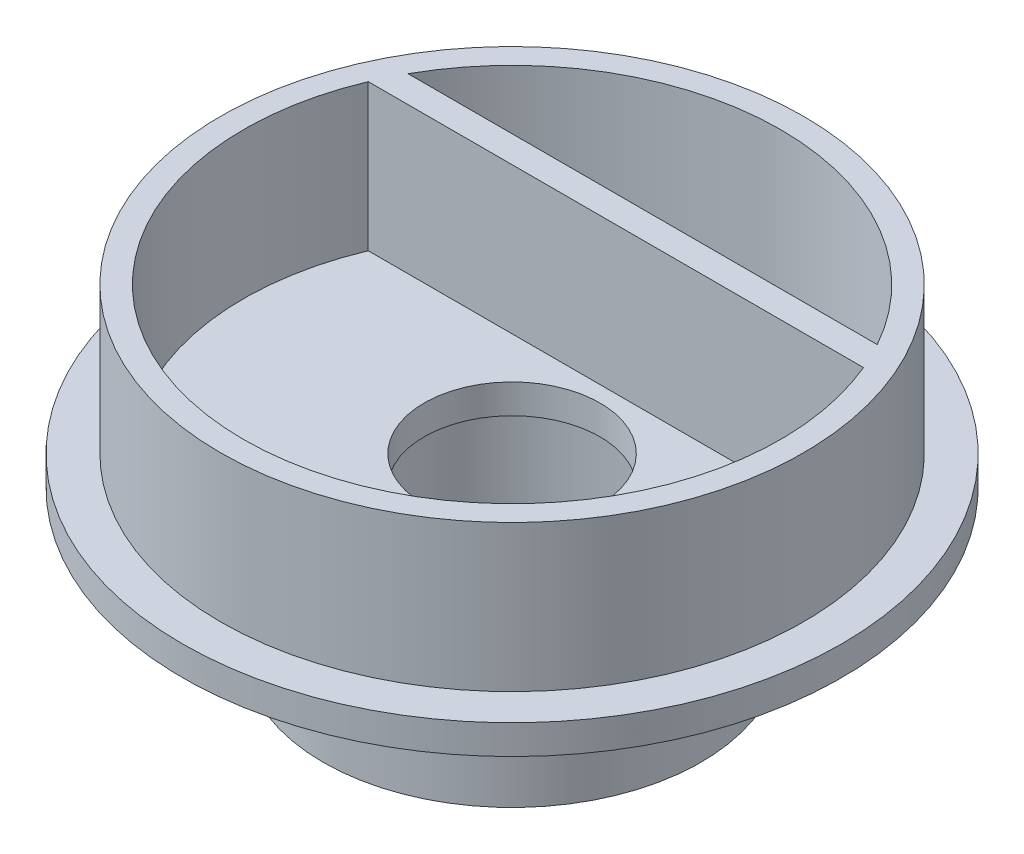
ISO-10303-21;
HEADER;
FILE_DESCRIPTION(('STEP AP214'),'2;1');
FILE_NAME('part.step','',(''),(''),'','','');
FILE_SCHEMA(('AUTOMOTIVE_DESIGN { 1 0 10303 214 1 1 1 1 }'));
ENDSEC;
DATA;
#1=APPLICATION_CONTEXT('core data for automotive mechanical design processes');
#2=APPLICATION_PROTOCOL_DEFINITION('international standard','automotive_design',2000,#1);
#3=PRODUCT_CONTEXT('',#1,'mechanical');
#4=PRODUCT('Part','Part','',(#3));
#5=PRODUCT_RELATED_PRODUCT_CATEGORY('part','',(#4));
#6=PRODUCT_DEFINITION_FORMATION('','',#4);
#7=PRODUCT_DEFINITION_CONTEXT('part definition',#1,'design');
#8=PRODUCT_DEFINITION('design','',#6,#7);
#9=PRODUCT_DEFINITION_SHAPE('','',#8);
#10=(LENGTH_UNIT() NAMED_UNIT(*) SI_UNIT(.MILLI.,.METRE.));
#11=(NAMED_UNIT(*) PLANE_ANGLE_UNIT() SI_UNIT($,.RADIAN.));
#12=(NAMED_UNIT(*) SI_UNIT($,.STERADIAN.) SOLID_ANGLE_UNIT());
#13=UNCERTAINTY_MEASURE_WITH_UNIT(LENGTH_MEASURE(1.E-05),#10,'distance_accuracy_value','');
#14=(GEOMETRIC_REPRESENTATION_CONTEXT(3) GLOBAL_UNCERTAINTY_ASSIGNED_CONTEXT((#13)) GLOBAL_UNIT_ASSIGNED_CONTEXT((#10,
#11,#12)) REPRESENTATION_CONTEXT('',''));
#15=CARTESIAN_POINT('',(0.,0.,0.));
#16=DIRECTION('',(0.,0.,1.));
#17=DIRECTION('',(1.,0.,0.));
#18=AXIS2_PLACEMENT_3D('',#15,#16,#17);
#19=CARTESIAN_POINT('',(0.,12.,0.));
#20=DIRECTION('',(0.,1.,0.));
#21=DIRECTION('',(0.,0.,1.));
#22=AXIS2_PLACEMENT_3D('',#19,#20,#21);
#23=PLANE('',#22);
#24=CARTESIAN_POINT('',(0.,12.,0.));
#25=DIRECTION('',(0.,1.,0.));
#26=DIRECTION('',(0.,0.,1.));
#27=AXIS2_PLACEMENT_3D('',#24,#25,#26);
#28=CIRCLE('',#27,18.3297555993307);
#29=CARTESIAN_POINT('',(16.9048097709622,12.,-7.08571428571429));
#30=VERTEX_POINT('',#29);
#31=CARTESIAN_POINT('',(-16.9048097709622,12.,-7.08571428571428));
#32=VERTEX_POINT('',#31);
#33=EDGE_CURVE('E234',#30,#32,#28,.F.);
#34=ORIENTED_EDGE('',*,*,#33,.T.);
#35=DIRECTION('',(1.,0.,0.));
#36=VECTOR('',#35,1.);
#37=CARTESIAN_POINT('',(0.,12.,-7.08571428571428));
#38=LINE('',#37,#36);
#39=EDGE_CURVE('E250',#32,#30,#38,.T.);
#40=ORIENTED_EDGE('',*,*,#39,.T.);
#41=EDGE_LOOP('',(#34,#40));
#42=FACE_BOUND('',#41,.T.);
#43=CARTESIAN_POINT('',(0.,12.,0.));
#44=DIRECTION('',(0.,1.,0.));
#45=DIRECTION('',(0.,0.,1.));
#46=AXIS2_PLACEMENT_3D('',#43,#44,#45);
#47=CIRCLE('',#46,18.3297555993307);
#48=CARTESIAN_POINT('',(-16.0160997291874,12.,-8.91428571428571));
#49=VERTEX_POINT('',#48);
#50=CARTESIAN_POINT('',(16.0160997291874,12.,-8.91428571428572));
#51=VERTEX_POINT('',#50);
#52=EDGE_CURVE('E246',#49,#51,#47,.F.);
#53=ORIENTED_EDGE('',*,*,#52,.T.);
#54=DIRECTION('',(1.,0.,0.));
#55=VECTOR('',#54,1.);
#56=CARTESIAN_POINT('',(0.,12.,-8.91428571428572));
#57=LINE('',#56,#55);
#58=EDGE_CURVE('E51',#51,#49,#57,.F.);
#59=ORIENTED_EDGE('',*,*,#58,.T.);
#60=EDGE_LOOP('',(#53,#59));
#61=FACE_BOUND('',#60,.T.);
#62=CARTESIAN_POINT('',(0.,12.,0.));
#63=DIRECTION('',(0.,1.,0.));
#64=DIRECTION('',(0.,0.,1.));
#65=AXIS2_PLACEMENT_3D('',#62,#63,#64);
#66=CIRCLE('',#65,19.9);
#67=CARTESIAN_POINT('',(0.,12.,19.9));
#68=VERTEX_POINT('',#67);
#69=EDGE_CURVE('E555',#68,#68,#66,.T.);
#70=ORIENTED_EDGE('',*,*,#69,.T.);
#71=EDGE_LOOP('',(#70));
#72=FACE_BOUND('',#71,.T.);
#73=ADVANCED_FACE('F41',(#42,#61,#72),#23,.T.);
#74=CARTESIAN_POINT('',(0.,0.,0.));
#75=DIRECTION('',(0.,1.,0.));
#76=DIRECTION('',(0.,0.,1.));
#77=AXIS2_PLACEMENT_3D('',#74,#75,#76);
#78=PLANE('',#77);
#79=CARTESIAN_POINT('',(0.,0.,0.));
#80=DIRECTION('',(0.,1.,0.));
#81=DIRECTION('',(0.,0.,1.));
#82=AXIS2_PLACEMENT_3D('',#79,#80,#81);
#83=CIRCLE('',#82,6.);
#84=CARTESIAN_POINT('',(0.,0.,6.));
#85=VERTEX_POINT('',#84);
#86=EDGE_CURVE('E178',#85,#85,#83,.T.);
#87=ORIENTED_EDGE('',*,*,#86,.T.);
#88=EDGE_LOOP('',(#87));
#89=FACE_BOUND('',#88,.T.);
#90=CARTESIAN_POINT('',(0.,0.,0.));
#91=DIRECTION('',(0.,-1.,0.));
#92=DIRECTION('',(0.,0.,-1.));
#93=AXIS2_PLACEMENT_3D('',#90,#91,#92);
#94=CIRCLE('',#93,8.9);
#95=CARTESIAN_POINT('',(0.,0.,-8.9));
#96=VERTEX_POINT('',#95);
#97=EDGE_CURVE('E559',#96,#96,#94,.T.);
#98=ORIENTED_EDGE('',*,*,#97,.T.);
#99=EDGE_LOOP('',(#98));
#100=FACE_BOUND('',#99,.T.);
#101=ADVANCED_FACE('F266',(#89,#100),#78,.F.);
#102=CARTESIAN_POINT('',(0.,0.,0.));
#103=DIRECTION('',(0.,1.,0.));
#104=DIRECTION('',(0.,0.,1.));
#105=AXIS2_PLACEMENT_3D('',#102,#103,#104);
#106=CYLINDRICAL_SURFACE('',#105,6.);
#107=ORIENTED_EDGE('',*,*,#86,.F.);
#108=EDGE_LOOP('',(#107));
#109=FACE_BOUND('',#108,.T.);
#110=CARTESIAN_POINT('',(0.,2.,0.));
#111=DIRECTION('',(0.,1.,0.));
#112=DIRECTION('',(0.,0.,1.));
#113=AXIS2_PLACEMENT_3D('',#110,#111,#112);
#114=CIRCLE('',#113,6.);
#115=CARTESIAN_POINT('',(0.,2.,6.));
#116=VERTEX_POINT('',#115);
#117=EDGE_CURVE('E230',#116,#116,#114,.F.);
#118=ORIENTED_EDGE('',*,*,#117,.F.);
#119=EDGE_LOOP('',(#118));
#120=FACE_BOUND('',#119,.T.);
#121=ADVANCED_FACE('F43',(#109,#120),#106,.F.);
#122=CARTESIAN_POINT('',(-6.34707736462882,0.,-10.4192685212483));
#123=DIRECTION('',(0.,0.,1.));
#124=DIRECTION('',(1.,0.,0.));
#125=AXIS2_PLACEMENT_3D('',#122,#123,#124);
#126=PLANE('',#125);
#127=DIRECTION('',(0.,1.,0.));
#128=VECTOR('',#127,1.);
#129=CARTESIAN_POINT('',(6.34707736462884,0.,-10.4192685212483));
#130=LINE('',#129,#128);
#131=CARTESIAN_POINT('',(6.34707736462884,2.,-10.4192685212483));
#132=VERTEX_POINT('',#131);
#133=CARTESIAN_POINT('',(6.34707736462884,0.,-10.4192685212483));
#134=VERTEX_POINT('',#133);
#135=EDGE_CURVE('E182',#132,#134,#130,.F.);
#136=ORIENTED_EDGE('',*,*,#135,.T.);
#137=DIRECTION('',(1.,0.,0.));
#138=VECTOR('',#137,1.);
#139=CARTESIAN_POINT('',(-6.34707736462882,0.,-10.4192685212483));
#140=LINE('',#139,#138);
#141=CARTESIAN_POINT('',(6.92285472670902,0.,-10.4192685212483));
#142=VERTEX_POINT('',#141);
#143=EDGE_CURVE('E12',#134,#142,#140,.T.);
#144=ORIENTED_EDGE('',*,*,#143,.T.);
#145=DIRECTION('',(0.,1.,0.));
#146=VECTOR('',#145,1.);
#147=CARTESIAN_POINT('',(6.92285472670902,-9.8,-10.4192685212483));
#148=LINE('',#147,#146);
#149=CARTESIAN_POINT('',(6.92285472670902,-9.8,-10.4192685212483));
#150=VERTEX_POINT('',#149);
#151=EDGE_CURVE('E139',#150,#142,#148,.T.);
#152=ORIENTED_EDGE('',*,*,#151,.F.);
#153=DIRECTION('',(1.,0.,0.));
#154=VECTOR('',#153,1.);
#155=CARTESIAN_POINT('',(-6.34707736462882,-9.8,-10.4192685212483));
#156=LINE('',#155,#154);
#157=CARTESIAN_POINT('',(-6.92285472670902,-9.8,-10.4192685212483));
#158=VERTEX_POINT('',#157);
#159=EDGE_CURVE('E132',#158,#150,#156,.T.);
#160=ORIENTED_EDGE('',*,*,#159,.F.);
#161=DIRECTION('',(0.,1.,0.));
#162=VECTOR('',#161,1.);
#163=CARTESIAN_POINT('',(-6.92285472670902,-9.8,-10.4192685212483));
#164=LINE('',#163,#162);
#165=CARTESIAN_POINT('',(-6.92285472670902,0.,-10.4192685212483));
#166=VERTEX_POINT('',#165);
#167=EDGE_CURVE('E137',#158,#166,#164,.T.);
#168=ORIENTED_EDGE('',*,*,#167,.T.);
#169=CARTESIAN_POINT('',(-6.34707736462882,0.,-10.4192685212483));
#170=VERTEX_POINT('',#169);
#171=EDGE_CURVE('E59',#166,#170,#140,.T.);
#172=ORIENTED_EDGE('',*,*,#171,.T.);
#173=DIRECTION('',(0.,1.,0.));
#174=VECTOR('',#173,1.);
#175=CARTESIAN_POINT('',(-6.34707736462882,0.,-10.4192685212483));
#176=LINE('',#175,#174);
#177=CARTESIAN_POINT('',(-6.34707736462882,2.,-10.4192685212483));
#178=VERTEX_POINT('',#177);
#179=EDGE_CURVE('E196',#170,#178,#176,.T.);
#180=ORIENTED_EDGE('',*,*,#179,.T.);
#181=DIRECTION('',(1.,0.,0.));
#182=VECTOR('',#181,1.);
#183=CARTESIAN_POINT('',(0.,2.,-10.4192685212483));
#184=LINE('',#183,#182);
#185=EDGE_CURVE('E220',#132,#178,#184,.F.);
#186=ORIENTED_EDGE('',*,*,#185,.F.);
#187=EDGE_LOOP('',(#136,#144,#152,#160,#168,#172,#180,#186));
#188=FACE_BOUND('',#187,.T.);
#189=ADVANCED_FACE('F135',(#188),#126,.F.);
#190=CARTESIAN_POINT('',(-6.34707736462883,0.,-15.4192685212483));
#191=DIRECTION('',(-1.,0.,0.));
#192=DIRECTION('',(0.,0.,1.));
#193=AXIS2_PLACEMENT_3D('',#190,#191,#192);
#194=PLANE('',#193);
#195=ORIENTED_EDGE('',*,*,#179,.F.);
#196=DIRECTION('',(0.,0.,1.));
#197=VECTOR('',#196,1.);
#198=CARTESIAN_POINT('',(-6.34707736462882,0.,0.));
#199=LINE('',#198,#197);
#200=CARTESIAN_POINT('',(-6.34707736462883,0.,-15.4192685212483));
#201=VERTEX_POINT('',#200);
#202=EDGE_CURVE('E200',#170,#201,#199,.F.);
#203=ORIENTED_EDGE('',*,*,#202,.T.);
#204=DIRECTION('',(0.,1.,0.));
#205=VECTOR('',#204,1.);
#206=CARTESIAN_POINT('',(-6.34707736462883,0.,-15.4192685212483));
#207=LINE('',#206,#205);
#208=CARTESIAN_POINT('',(-6.34707736462883,2.,-15.4192685212483));
#209=VERTEX_POINT('',#208);
#210=EDGE_CURVE('E186',#201,#209,#207,.T.);
#211=ORIENTED_EDGE('',*,*,#210,.T.);
#212=DIRECTION('',(0.,0.,1.));
#213=VECTOR('',#212,1.);
#214=CARTESIAN_POINT('',(-6.34707736462882,2.,0.));
#215=LINE('',#214,#213);
#216=EDGE_CURVE('E211',#178,#209,#215,.F.);
#217=ORIENTED_EDGE('',*,*,#216,.F.);
#218=EDGE_LOOP('',(#195,#203,#211,#217));
#219=FACE_BOUND('',#218,.T.);
#220=ADVANCED_FACE('F273',(#219),#194,.F.);
#221=CARTESIAN_POINT('',(6.34707736462884,0.,-15.4192685212483));
#222=DIRECTION('',(0.,0.,-1.));
#223=DIRECTION('',(-1.,0.,0.));
#224=AXIS2_PLACEMENT_3D('',#221,#222,#223);
#225=PLANE('',#224);
#226=ORIENTED_EDGE('',*,*,#210,.F.);
#227=DIRECTION('',(1.,0.,0.));
#228=VECTOR('',#227,1.);
#229=CARTESIAN_POINT('',(0.,0.,-15.4192685212483));
#230=LINE('',#229,#228);
#231=CARTESIAN_POINT('',(6.34707736462884,0.,-15.4192685212483));
#232=VERTEX_POINT('',#231);
#233=EDGE_CURVE('E193',#201,#232,#230,.T.);
#234=ORIENTED_EDGE('',*,*,#233,.T.);
#235=DIRECTION('',(0.,1.,0.));
#236=VECTOR('',#235,1.);
#237=CARTESIAN_POINT('',(6.34707736462883,0.,-15.4192685212483));
#238=LINE('',#237,#236);
#239=CARTESIAN_POINT('',(6.34707736462884,2.,-15.4192685212483));
#240=VERTEX_POINT('',#239);
#241=EDGE_CURVE('E185',#232,#240,#238,.T.);
#242=ORIENTED_EDGE('',*,*,#241,.T.);
#243=DIRECTION('',(1.,0.,0.));
#244=VECTOR('',#243,1.);
#245=CARTESIAN_POINT('',(0.,2.,-15.4192685212483));
#246=LINE('',#245,#244);
#247=EDGE_CURVE('E202',#209,#240,#246,.T.);
#248=ORIENTED_EDGE('',*,*,#247,.F.);
#249=EDGE_LOOP('',(#226,#234,#242,#248));
#250=FACE_BOUND('',#249,.T.);
#251=ADVANCED_FACE('F315',(#250),#225,.F.);
#252=CARTESIAN_POINT('',(6.34707736462884,0.,-10.4192685212483));
#253=DIRECTION('',(1.,0.,0.));
#254=DIRECTION('',(0.,0.,-1.));
#255=AXIS2_PLACEMENT_3D('',#252,#253,#254);
#256=PLANE('',#255);
#257=ORIENTED_EDGE('',*,*,#241,.F.);
#258=DIRECTION('',(0.,0.,1.));
#259=VECTOR('',#258,1.);
#260=CARTESIAN_POINT('',(6.34707736462884,0.,0.));
#261=LINE('',#260,#259);
#262=EDGE_CURVE('E189',#232,#134,#261,.T.);
#263=ORIENTED_EDGE('',*,*,#262,.T.);
#264=ORIENTED_EDGE('',*,*,#135,.F.);
#265=DIRECTION('',(0.,0.,1.));
#266=VECTOR('',#265,1.);
#267=CARTESIAN_POINT('',(6.34707736462884,2.,0.));
#268=LINE('',#267,#266);
#269=EDGE_CURVE('E227',#240,#132,#268,.T.);
#270=ORIENTED_EDGE('',*,*,#269,.F.);
#271=EDGE_LOOP('',(#257,#263,#264,#270));
#272=FACE_BOUND('',#271,.T.);
#273=ADVANCED_FACE('F312',(#272),#256,.F.);
#274=CARTESIAN_POINT('',(0.,2.,0.));
#275=DIRECTION('',(0.,1.,0.));
#276=DIRECTION('',(0.,0.,1.));
#277=AXIS2_PLACEMENT_3D('',#274,#275,#276);
#278=PLANE('',#277);
#279=ORIENTED_EDGE('',*,*,#117,.T.);
#280=EDGE_LOOP('',(#279));
#281=FACE_BOUND('',#280,.T.);
#282=CARTESIAN_POINT('',(0.,2.,0.));
#283=DIRECTION('',(0.,1.,0.));
#284=DIRECTION('',(0.,0.,1.));
#285=AXIS2_PLACEMENT_3D('',#282,#283,#284);
#286=CIRCLE('',#285,18.3297555993307);
#287=CARTESIAN_POINT('',(-16.9048097709622,2.,-7.08571428571429));
#288=VERTEX_POINT('',#287);
#289=CARTESIAN_POINT('',(16.9048097709622,2.,-7.08571428571429));
#290=VERTEX_POINT('',#289);
#291=EDGE_CURVE('E192',#288,#290,#286,.T.);
#292=ORIENTED_EDGE('',*,*,#291,.T.);
#293=DIRECTION('',(-1.,0.,0.));
#294=VECTOR('',#293,1.);
#295=CARTESIAN_POINT('',(16.9048097709622,2.,-7.08571428571429));
#296=LINE('',#295,#294);
#297=EDGE_CURVE('E236',#290,#288,#296,.T.);
#298=ORIENTED_EDGE('',*,*,#297,.T.);
#299=EDGE_LOOP('',(#292,#298));
#300=FACE_BOUND('',#299,.T.);
#301=ADVANCED_FACE('F262',(#281,#300),#278,.T.);
#302=CARTESIAN_POINT('',(0.,2.,0.));
#303=DIRECTION('',(0.,1.,0.));
#304=DIRECTION('',(0.,0.,1.));
#305=AXIS2_PLACEMENT_3D('',#302,#303,#304);
#306=PLANE('',#305);
#307=ORIENTED_EDGE('',*,*,#216,.T.);
#308=ORIENTED_EDGE('',*,*,#247,.T.);
#309=ORIENTED_EDGE('',*,*,#269,.T.);
#310=ORIENTED_EDGE('',*,*,#185,.T.);
#311=EDGE_LOOP('',(#307,#308,#309,#310));
#312=FACE_BOUND('',#311,.T.);
#313=CARTESIAN_POINT('',(0.,2.,0.));
#314=DIRECTION('',(0.,1.,0.));
#315=DIRECTION('',(0.,0.,1.));
#316=AXIS2_PLACEMENT_3D('',#313,#314,#315);
#317=CIRCLE('',#316,18.3297555993307);
#318=CARTESIAN_POINT('',(16.0160997291874,2.,-8.91428571428572));
#319=VERTEX_POINT('',#318);
#320=CARTESIAN_POINT('',(-16.0160997291874,2.,-8.91428571428571));
#321=VERTEX_POINT('',#320);
#322=EDGE_CURVE('E240',#319,#321,#317,.T.);
#323=ORIENTED_EDGE('',*,*,#322,.T.);
#324=DIRECTION('',(1.,0.,0.));
#325=VECTOR('',#324,1.);
#326=CARTESIAN_POINT('',(-16.0160997291874,2.,-8.91428571428571));
#327=LINE('',#326,#325);
#328=EDGE_CURVE('E231',#321,#319,#327,.T.);
#329=ORIENTED_EDGE('',*,*,#328,.T.);
#330=EDGE_LOOP('',(#323,#329));
#331=FACE_BOUND('',#330,.T.);
#332=ADVANCED_FACE('F307',(#312,#331),#306,.T.);
#333=ORIENTED_EDGE('',*,*,#171,.F.);
#334=CARTESIAN_POINT('',(-6.92285472670902,0.,-8.4192685212483));
#335=DIRECTION('',(0.,-1.,0.));
#336=DIRECTION('',(0.,0.,1.));
#337=AXIS2_PLACEMENT_3D('',#334,#335,#336);
#338=CIRCLE('',#337,2.);
#339=CARTESIAN_POINT('',(-8.19310330041711,0.,-9.96408843340395));
#340=VERTEX_POINT('',#339);
#341=EDGE_CURVE('E64',#340,#166,#338,.T.);
#342=ORIENTED_EDGE('',*,*,#341,.F.);
#343=CARTESIAN_POINT('',(0.,0.,0.));
#344=DIRECTION('',(0.,-1.,0.));
#345=DIRECTION('',(0.,0.,-1.));
#346=AXIS2_PLACEMENT_3D('',#343,#344,#345);
#347=CIRCLE('',#346,12.9);
#348=CARTESIAN_POINT('',(8.19310330041711,0.,-9.96408843340395));
#349=VERTEX_POINT('',#348);
#350=EDGE_CURVE('E155',#349,#340,#347,.T.);
#351=ORIENTED_EDGE('',*,*,#350,.F.);
#352=CARTESIAN_POINT('',(6.92285472670902,0.,-8.4192685212483));
#353=DIRECTION('',(0.,-1.,0.));
#354=DIRECTION('',(0.,0.,1.));
#355=AXIS2_PLACEMENT_3D('',#352,#353,#354);
#356=CIRCLE('',#355,2.);
#357=EDGE_CURVE('E175',#142,#349,#356,.T.);
#358=ORIENTED_EDGE('',*,*,#357,.F.);
#359=ORIENTED_EDGE('',*,*,#143,.F.);
#360=ORIENTED_EDGE('',*,*,#262,.F.);
#361=ORIENTED_EDGE('',*,*,#233,.F.);
#362=ORIENTED_EDGE('',*,*,#202,.F.);
#363=EDGE_LOOP('',(#333,#342,#351,#358,#359,#360,#361,#362));
#364=FACE_BOUND('',#363,.T.);
#365=CARTESIAN_POINT('',(0.,0.,0.));
#366=DIRECTION('',(0.,-1.,0.));
#367=DIRECTION('',(0.,0.,-1.));
#368=AXIS2_PLACEMENT_3D('',#365,#366,#367);
#369=CIRCLE('',#368,22.5);
#370=CARTESIAN_POINT('',(0.,0.,-22.5));
#371=VERTEX_POINT('',#370);
#372=EDGE_CURVE('E165',#371,#371,#369,.T.);
#373=ORIENTED_EDGE('',*,*,#372,.T.);
#374=EDGE_LOOP('',(#373));
#375=FACE_BOUND('',#374,.T.);
#376=ADVANCED_FACE('F276',(#364,#375),#78,.F.);
#377=CARTESIAN_POINT('',(0.,2.,0.));
#378=DIRECTION('',(0.,1.,0.));
#379=DIRECTION('',(0.,0.,1.));
#380=AXIS2_PLACEMENT_3D('',#377,#378,#379);
#381=CYLINDRICAL_SURFACE('',#380,18.3297555993307);
#382=DIRECTION('',(0.,1.,0.));
#383=VECTOR('',#382,1.);
#384=CARTESIAN_POINT('',(-16.9048097709622,2.,-7.08571428571429));
#385=LINE('',#384,#383);
#386=EDGE_CURVE('E257',#288,#32,#385,.T.);
#387=ORIENTED_EDGE('',*,*,#386,.T.);
#388=ORIENTED_EDGE('',*,*,#33,.F.);
#389=DIRECTION('',(0.,1.,0.));
#390=VECTOR('',#389,1.);
#391=CARTESIAN_POINT('',(16.9048097709622,2.,-7.08571428571429));
#392=LINE('',#391,#390);
#393=EDGE_CURVE('E241',#30,#290,#392,.F.);
#394=ORIENTED_EDGE('',*,*,#393,.T.);
#395=ORIENTED_EDGE('',*,*,#291,.F.);
#396=EDGE_LOOP('',(#387,#388,#394,#395));
#397=FACE_BOUND('',#396,.T.);
#398=ADVANCED_FACE('F301',(#397),#381,.F.);
#399=CARTESIAN_POINT('',(16.9048097709622,2.,-7.08571428571429));
#400=DIRECTION('',(0.,0.,-1.));
#401=DIRECTION('',(-1.,0.,0.));
#402=AXIS2_PLACEMENT_3D('',#399,#400,#401);
#403=PLANE('',#402);
#404=ORIENTED_EDGE('',*,*,#393,.F.);
#405=ORIENTED_EDGE('',*,*,#39,.F.);
#406=ORIENTED_EDGE('',*,*,#386,.F.);
#407=ORIENTED_EDGE('',*,*,#297,.F.);
#408=EDGE_LOOP('',(#404,#405,#406,#407));
#409=FACE_BOUND('',#408,.T.);
#410=ADVANCED_FACE('F297',(#409),#403,.F.);
#411=CARTESIAN_POINT('',(0.,2.,0.));
#412=DIRECTION('',(0.,1.,0.));
#413=DIRECTION('',(0.,0.,1.));
#414=AXIS2_PLACEMENT_3D('',#411,#412,#413);
#415=CYLINDRICAL_SURFACE('',#414,18.3297555993307);
#416=DIRECTION('',(0.,1.,0.));
#417=VECTOR('',#416,1.);
#418=CARTESIAN_POINT('',(16.0160997291874,2.,-8.91428571428572));
#419=LINE('',#418,#417);
#420=EDGE_CURVE('E255',#319,#51,#419,.T.);
#421=ORIENTED_EDGE('',*,*,#420,.T.);
#422=ORIENTED_EDGE('',*,*,#52,.F.);
#423=DIRECTION('',(0.,1.,0.));
#424=VECTOR('',#423,1.);
#425=CARTESIAN_POINT('',(-16.0160997291874,2.,-8.91428571428571));
#426=LINE('',#425,#424);
#427=EDGE_CURVE('E235',#49,#321,#426,.F.);
#428=ORIENTED_EDGE('',*,*,#427,.T.);
#429=ORIENTED_EDGE('',*,*,#322,.F.);
#430=EDGE_LOOP('',(#421,#422,#428,#429));
#431=FACE_BOUND('',#430,.T.);
#432=ADVANCED_FACE('F293',(#431),#415,.F.);
#433=CARTESIAN_POINT('',(-16.0160997291874,2.,-8.91428571428571));
#434=DIRECTION('',(0.,0.,1.));
#435=DIRECTION('',(1.,0.,0.));
#436=AXIS2_PLACEMENT_3D('',#433,#434,#435);
#437=PLANE('',#436);
#438=ORIENTED_EDGE('',*,*,#427,.F.);
#439=ORIENTED_EDGE('',*,*,#58,.F.);
#440=ORIENTED_EDGE('',*,*,#420,.F.);
#441=ORIENTED_EDGE('',*,*,#328,.F.);
#442=EDGE_LOOP('',(#438,#439,#440,#441));
#443=FACE_BOUND('',#442,.T.);
#444=ADVANCED_FACE('F290',(#443),#437,.F.);
#445=CARTESIAN_POINT('',(0.,2.,0.));
#446=DIRECTION('',(0.,1.,0.));
#447=DIRECTION('',(0.,0.,1.));
#448=AXIS2_PLACEMENT_3D('',#445,#446,#447);
#449=PLANE('',#448);
#450=CARTESIAN_POINT('',(0.,2.,0.));
#451=DIRECTION('',(0.,1.,0.));
#452=DIRECTION('',(0.,0.,1.));
#453=AXIS2_PLACEMENT_3D('',#450,#451,#452);
#454=CIRCLE('',#453,22.5);
#455=CARTESIAN_POINT('',(0.,2.,22.5));
#456=VERTEX_POINT('',#455);
#457=EDGE_CURVE('E159',#456,#456,#454,.F.);
#458=ORIENTED_EDGE('',*,*,#457,.F.);
#459=EDGE_LOOP('',(#458));
#460=FACE_BOUND('',#459,.T.);
#461=CARTESIAN_POINT('',(0.,2.,0.));
#462=DIRECTION('',(0.,1.,0.));
#463=DIRECTION('',(0.,0.,1.));
#464=AXIS2_PLACEMENT_3D('',#461,#462,#463);
#465=CIRCLE('',#464,19.9);
#466=CARTESIAN_POINT('',(0.,2.,19.9));
#467=VERTEX_POINT('',#466);
#468=EDGE_CURVE('E552',#467,#467,#465,.T.);
#469=ORIENTED_EDGE('',*,*,#468,.F.);
#470=EDGE_LOOP('',(#469));
#471=FACE_BOUND('',#470,.T.);
#472=ADVANCED_FACE('F277',(#460,#471),#449,.T.);
#473=CARTESIAN_POINT('',(0.,65.6396103067893,0.));
#474=DIRECTION('',(0.,-1.,0.));
#475=DIRECTION('',(0.,0.,-1.));
#476=AXIS2_PLACEMENT_3D('',#473,#474,#475);
#477=CYLINDRICAL_SURFACE('',#476,22.5);
#478=ORIENTED_EDGE('',*,*,#372,.F.);
#479=EDGE_LOOP('',(#478));
#480=FACE_BOUND('',#479,.T.);
#481=ORIENTED_EDGE('',*,*,#457,.T.);
#482=EDGE_LOOP('',(#481));
#483=FACE_BOUND('',#482,.T.);
#484=ADVANCED_FACE('F268',(#480,#483),#477,.T.);
#485=CARTESIAN_POINT('',(-6.92285472670902,-9.8,-8.4192685212483));
#486=DIRECTION('',(0.,1.,0.));
#487=DIRECTION('',(0.,0.,1.));
#488=AXIS2_PLACEMENT_3D('',#485,#486,#487);
#489=PLANE('',#488);
#490=CARTESIAN_POINT('',(-6.92285472670902,-9.8,-8.4192685212483));
#491=DIRECTION('',(0.,-1.,0.));
#492=DIRECTION('',(0.,0.,1.));
#493=AXIS2_PLACEMENT_3D('',#490,#491,#492);
#494=CIRCLE('',#493,2.);
#495=CARTESIAN_POINT('',(-8.19310330041711,-9.8,-9.96408843340395));
#496=VERTEX_POINT('',#495);
#497=EDGE_CURVE('E144',#496,#158,#494,.T.);
#498=ORIENTED_EDGE('',*,*,#497,.T.);
#499=ORIENTED_EDGE('',*,*,#159,.T.);
#500=CARTESIAN_POINT('',(6.92285472670902,-9.8,-8.4192685212483));
#501=DIRECTION('',(0.,-1.,0.));
#502=DIRECTION('',(0.,0.,1.));
#503=AXIS2_PLACEMENT_3D('',#500,#501,#502);
#504=CIRCLE('',#503,2.);
#505=CARTESIAN_POINT('',(8.19310330041711,-9.8,-9.96408843340395));
#506=VERTEX_POINT('',#505);
#507=EDGE_CURVE('E143',#150,#506,#504,.T.);
#508=ORIENTED_EDGE('',*,*,#507,.T.);
#509=CARTESIAN_POINT('',(0.,-9.8,0.));
#510=DIRECTION('',(0.,-1.,0.));
#511=DIRECTION('',(0.,0.,-1.));
#512=AXIS2_PLACEMENT_3D('',#509,#510,#511);
#513=CIRCLE('',#512,12.9);
#514=EDGE_CURVE('E150',#506,#496,#513,.T.);
#515=ORIENTED_EDGE('',*,*,#514,.T.);
#516=EDGE_LOOP('',(#498,#499,#508,#515));
#517=FACE_BOUND('',#516,.T.);
#518=CARTESIAN_POINT('',(0.,-9.8,0.));
#519=DIRECTION('',(0.,-1.,0.));
#520=DIRECTION('',(0.,0.,-1.));
#521=AXIS2_PLACEMENT_3D('',#518,#519,#520);
#522=CIRCLE('',#521,8.9);
#523=CARTESIAN_POINT('',(0.,-9.8,-8.9));
#524=VERTEX_POINT('',#523);
#525=EDGE_CURVE('E344',#524,#524,#522,.T.);
#526=ORIENTED_EDGE('',*,*,#525,.F.);
#527=EDGE_LOOP('',(#526));
#528=FACE_BOUND('',#527,.T.);
#529=ADVANCED_FACE('F147',(#517,#528),#489,.F.);
#530=CARTESIAN_POINT('',(-6.92285472670902,-9.8,-8.4192685212483));
#531=DIRECTION('',(0.,1.,0.));
#532=DIRECTION('',(0.,0.,1.));
#533=AXIS2_PLACEMENT_3D('',#530,#531,#532);
#534=CYLINDRICAL_SURFACE('',#533,2.);
#535=ORIENTED_EDGE('',*,*,#341,.T.);
#536=ORIENTED_EDGE('',*,*,#167,.F.);
#537=ORIENTED_EDGE('',*,*,#497,.F.);
#538=DIRECTION('',(0.,1.,0.));
#539=VECTOR('',#538,1.);
#540=CARTESIAN_POINT('',(-8.19310330041711,-9.8,-9.96408843340395));
#541=LINE('',#540,#539);
#542=EDGE_CURVE('E339',#496,#340,#541,.T.);
#543=ORIENTED_EDGE('',*,*,#542,.T.);
#544=EDGE_LOOP('',(#535,#536,#537,#543));
#545=FACE_BOUND('',#544,.T.);
#546=ADVANCED_FACE('F157',(#545),#534,.T.);
#547=CARTESIAN_POINT('',(6.92285472670902,-9.8,-8.4192685212483));
#548=DIRECTION('',(0.,1.,0.));
#549=DIRECTION('',(0.,0.,1.));
#550=AXIS2_PLACEMENT_3D('',#547,#548,#549);
#551=CYLINDRICAL_SURFACE('',#550,2.);
#552=ORIENTED_EDGE('',*,*,#357,.T.);
#553=DIRECTION('',(0.,1.,0.));
#554=VECTOR('',#553,1.);
#555=CARTESIAN_POINT('',(8.19310330041711,-9.8,-9.96408843340395));
#556=LINE('',#555,#554);
#557=EDGE_CURVE('E168',#506,#349,#556,.T.);
#558=ORIENTED_EDGE('',*,*,#557,.F.);
#559=ORIENTED_EDGE('',*,*,#507,.F.);
#560=ORIENTED_EDGE('',*,*,#151,.T.);
#561=EDGE_LOOP('',(#552,#558,#559,#560));
#562=FACE_BOUND('',#561,.T.);
#563=ADVANCED_FACE('F333',(#562),#551,.T.);
#564=CARTESIAN_POINT('',(0.,-9.8,0.));
#565=DIRECTION('',(0.,1.,0.));
#566=DIRECTION('',(0.,0.,1.));
#567=AXIS2_PLACEMENT_3D('',#564,#565,#566);
#568=CYLINDRICAL_SURFACE('',#567,12.9);
#569=ORIENTED_EDGE('',*,*,#350,.T.);
#570=ORIENTED_EDGE('',*,*,#542,.F.);
#571=ORIENTED_EDGE('',*,*,#514,.F.);
#572=ORIENTED_EDGE('',*,*,#557,.T.);
#573=EDGE_LOOP('',(#569,#570,#571,#572));
#574=FACE_BOUND('',#573,.T.);
#575=ADVANCED_FACE('F352',(#574),#568,.T.);
#576=CARTESIAN_POINT('',(0.,-9.8,0.));
#577=DIRECTION('',(0.,1.,0.));
#578=DIRECTION('',(0.,0.,1.));
#579=AXIS2_PLACEMENT_3D('',#576,#577,#578);
#580=CYLINDRICAL_SURFACE('',#579,8.9);
#581=ORIENTED_EDGE('',*,*,#525,.T.);
#582=EDGE_LOOP('',(#581));
#583=FACE_BOUND('',#582,.T.);
#584=ORIENTED_EDGE('',*,*,#97,.F.);
#585=EDGE_LOOP('',(#584));
#586=FACE_BOUND('',#585,.T.);
#587=ADVANCED_FACE('F354',(#583,#586),#580,.F.);
#588=CARTESIAN_POINT('',(0.,2.,0.));
#589=DIRECTION('',(0.,1.,0.));
#590=DIRECTION('',(0.,0.,1.));
#591=AXIS2_PLACEMENT_3D('',#588,#589,#590);
#592=CYLINDRICAL_SURFACE('',#591,19.9);
#593=ORIENTED_EDGE('',*,*,#468,.T.);
#594=EDGE_LOOP('',(#593));
#595=FACE_BOUND('',#594,.T.);
#596=ORIENTED_EDGE('',*,*,#69,.F.);
#597=EDGE_LOOP('',(#596));
#598=FACE_BOUND('',#597,.T.);
#599=ADVANCED_FACE('F360',(#595,#598),#592,.T.);
#600=CLOSED_SHELL('',(#73,#101,#121,#189,#220,#251,#273,#301,#332,#376,#398,#410,#432,#444,#472,
#484,#529,#546,#563,#575,#587,#599));
#601=MANIFOLD_SOLID_BREP('B2',#600);
#602=ADVANCED_BREP_SHAPE_REPRESENTATION('',(#18,#601),#14);
#603=SHAPE_DEFINITION_REPRESENTATION(#9,#602);
ENDSEC;
END-ISO-10303-21;
